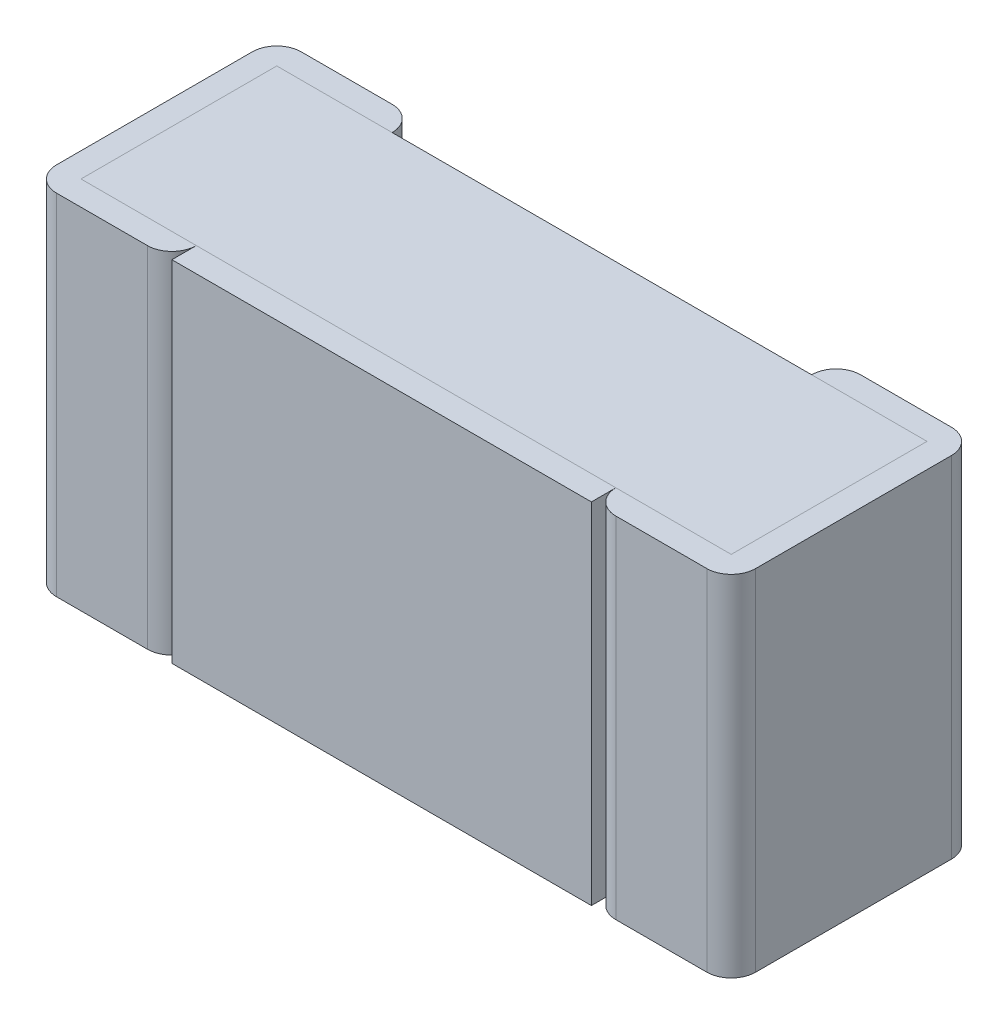
ISO-10303-21;
HEADER;
FILE_DESCRIPTION(('STEP AP214'),'2;1');
FILE_NAME('part.step','',(''),(''),'','','');
FILE_SCHEMA(('AUTOMOTIVE_DESIGN { 1 0 10303 214 1 1 1 1 }'));
ENDSEC;
DATA;
#1=APPLICATION_CONTEXT('core data for automotive mechanical design processes');
#2=APPLICATION_PROTOCOL_DEFINITION('international standard','automotive_design',2000,#1);
#3=PRODUCT_CONTEXT('',#1,'mechanical');
#4=PRODUCT('Part','Part','',(#3));
#5=PRODUCT_RELATED_PRODUCT_CATEGORY('part','',(#4));
#6=PRODUCT_DEFINITION_FORMATION('','',#4);
#7=PRODUCT_DEFINITION_CONTEXT('part definition',#1,'design');
#8=PRODUCT_DEFINITION('design','',#6,#7);
#9=PRODUCT_DEFINITION_SHAPE('','',#8);
#10=(LENGTH_UNIT() NAMED_UNIT(*) SI_UNIT(.MILLI.,.METRE.));
#11=(NAMED_UNIT(*) PLANE_ANGLE_UNIT() SI_UNIT($,.RADIAN.));
#12=(NAMED_UNIT(*) SI_UNIT($,.STERADIAN.) SOLID_ANGLE_UNIT());
#13=UNCERTAINTY_MEASURE_WITH_UNIT(LENGTH_MEASURE(1.E-05),#10,'distance_accuracy_value','');
#14=(GEOMETRIC_REPRESENTATION_CONTEXT(3) GLOBAL_UNCERTAINTY_ASSIGNED_CONTEXT((#13)) GLOBAL_UNIT_ASSIGNED_CONTEXT((#10,
#11,#12)) REPRESENTATION_CONTEXT('',''));
#15=CARTESIAN_POINT('',(0.,0.,0.));
#16=DIRECTION('',(0.,0.,1.));
#17=DIRECTION('',(1.,0.,0.));
#18=AXIS2_PLACEMENT_3D('',#15,#16,#17);
#19=CARTESIAN_POINT('',(-0.3,-0.25,0.35));
#20=DIRECTION('',(0.,0.,1.));
#21=DIRECTION('',(1.,0.,0.));
#22=AXIS2_PLACEMENT_3D('',#19,#20,#21);
#23=PLANE('',#22);
#24=DIRECTION('',(0.,1.,0.));
#25=VECTOR('',#24,1.);
#26=CARTESIAN_POINT('',(-0.3,-0.25,0.35));
#27=LINE('',#26,#25);
#28=CARTESIAN_POINT('',(-0.3,-0.25,0.35));
#29=VERTEX_POINT('',#28);
#30=CARTESIAN_POINT('',(-0.3,0.25,0.35));
#31=VERTEX_POINT('',#30);
#32=EDGE_CURVE('E232',#29,#31,#27,.T.);
#33=ORIENTED_EDGE('',*,*,#32,.F.);
#34=DIRECTION('',(1.,0.,0.));
#35=VECTOR('',#34,1.);
#36=CARTESIAN_POINT('',(-0.3,-0.25,0.35));
#37=LINE('',#36,#35);
#38=CARTESIAN_POINT('',(0.3,-0.25,0.35));
#39=VERTEX_POINT('',#38);
#40=EDGE_CURVE('E344',#29,#39,#37,.T.);
#41=ORIENTED_EDGE('',*,*,#40,.T.);
#42=DIRECTION('',(0.,1.,0.));
#43=VECTOR('',#42,1.);
#44=CARTESIAN_POINT('',(0.3,-0.25,0.35));
#45=LINE('',#44,#43);
#46=CARTESIAN_POINT('',(0.3,0.25,0.35));
#47=VERTEX_POINT('',#46);
#48=EDGE_CURVE('E11',#39,#47,#45,.T.);
#49=ORIENTED_EDGE('',*,*,#48,.T.);
#50=DIRECTION('',(1.,0.,0.));
#51=VECTOR('',#50,1.);
#52=CARTESIAN_POINT('',(-0.3,0.25,0.35));
#53=LINE('',#52,#51);
#54=EDGE_CURVE('E279',#31,#47,#53,.T.);
#55=ORIENTED_EDGE('',*,*,#54,.F.);
#56=EDGE_LOOP('',(#33,#41,#49,#55));
#57=FACE_BOUND('',#56,.T.);
#58=ADVANCED_FACE('F17',(#57),#23,.T.);
#59=CARTESIAN_POINT('',(0.3,-0.25,0.315));
#60=DIRECTION('',(1.,0.,0.));
#61=DIRECTION('',(0.,1.,0.));
#62=AXIS2_PLACEMENT_3D('',#59,#60,#61);
#63=PLANE('',#62);
#64=DIRECTION('',(0.,0.,1.));
#65=VECTOR('',#64,1.);
#66=CARTESIAN_POINT('',(0.3,-0.25,0.315));
#67=LINE('',#66,#65);
#68=CARTESIAN_POINT('',(0.3,-0.25,0.315));
#69=VERTEX_POINT('',#68);
#70=EDGE_CURVE('E340',#69,#39,#67,.T.);
#71=ORIENTED_EDGE('',*,*,#70,.F.);
#72=DIRECTION('',(0.,1.,0.));
#73=VECTOR('',#72,1.);
#74=CARTESIAN_POINT('',(0.3,-0.25,0.315));
#75=LINE('',#74,#73);
#76=CARTESIAN_POINT('',(0.3,0.25,0.315));
#77=VERTEX_POINT('',#76);
#78=EDGE_CURVE('E28',#69,#77,#75,.T.);
#79=ORIENTED_EDGE('',*,*,#78,.T.);
#80=DIRECTION('',(0.,0.,1.));
#81=VECTOR('',#80,1.);
#82=CARTESIAN_POINT('',(0.3,0.25,0.315));
#83=LINE('',#82,#81);
#84=EDGE_CURVE('E242',#77,#47,#83,.T.);
#85=ORIENTED_EDGE('',*,*,#84,.T.);
#86=ORIENTED_EDGE('',*,*,#48,.F.);
#87=EDGE_LOOP('',(#71,#79,#85,#86));
#88=FACE_BOUND('',#87,.T.);
#89=ADVANCED_FACE('F538',(#88),#63,.T.);
#90=CARTESIAN_POINT('',(0.335,-0.25,0.315));
#91=DIRECTION('',(0.,1.,0.));
#92=DIRECTION('',(-1.,0.,0.));
#93=AXIS2_PLACEMENT_3D('',#90,#91,#92);
#94=CYLINDRICAL_SURFACE('',#93,0.035);
#95=CARTESIAN_POINT('',(0.335,-0.25,0.315));
#96=DIRECTION('',(0.,1.,0.));
#97=DIRECTION('',(0.,0.,1.));
#98=AXIS2_PLACEMENT_3D('',#95,#96,#97);
#99=CIRCLE('',#98,0.035);
#100=CARTESIAN_POINT('',(0.335,-0.25,0.35));
#101=VERTEX_POINT('',#100);
#102=EDGE_CURVE('E375',#69,#101,#99,.T.);
#103=ORIENTED_EDGE('',*,*,#102,.T.);
#104=DIRECTION('',(0.,1.,0.));
#105=VECTOR('',#104,1.);
#106=CARTESIAN_POINT('',(0.335,-0.25,0.35));
#107=LINE('',#106,#105);
#108=CARTESIAN_POINT('',(0.335,0.25,0.35));
#109=VERTEX_POINT('',#108);
#110=EDGE_CURVE('E363',#101,#109,#107,.T.);
#111=ORIENTED_EDGE('',*,*,#110,.T.);
#112=CARTESIAN_POINT('',(0.335,0.25,0.315));
#113=DIRECTION('',(0.,1.,0.));
#114=DIRECTION('',(0.,0.,1.));
#115=AXIS2_PLACEMENT_3D('',#112,#113,#114);
#116=CIRCLE('',#115,0.035);
#117=EDGE_CURVE('E320',#77,#109,#116,.T.);
#118=ORIENTED_EDGE('',*,*,#117,.F.);
#119=ORIENTED_EDGE('',*,*,#78,.F.);
#120=EDGE_LOOP('',(#103,#111,#118,#119));
#121=FACE_BOUND('',#120,.T.);
#122=ADVANCED_FACE('F544',(#121),#94,.T.);
#123=CARTESIAN_POINT('',(0.3,-0.25,0.35));
#124=DIRECTION('',(0.,0.,1.));
#125=DIRECTION('',(1.,0.,0.));
#126=AXIS2_PLACEMENT_3D('',#123,#124,#125);
#127=PLANE('',#126);
#128=DIRECTION('',(1.,0.,0.));
#129=VECTOR('',#128,1.);
#130=CARTESIAN_POINT('',(0.3,0.25,0.35));
#131=LINE('',#130,#129);
#132=CARTESIAN_POINT('',(0.465,0.25,0.35));
#133=VERTEX_POINT('',#132);
#134=EDGE_CURVE('E315',#109,#133,#131,.T.);
#135=ORIENTED_EDGE('',*,*,#134,.F.);
#136=ORIENTED_EDGE('',*,*,#110,.F.);
#137=DIRECTION('',(1.,0.,0.));
#138=VECTOR('',#137,1.);
#139=CARTESIAN_POINT('',(0.3,-0.25,0.35));
#140=LINE('',#139,#138);
#141=CARTESIAN_POINT('',(0.465,-0.25,0.35));
#142=VERTEX_POINT('',#141);
#143=EDGE_CURVE('E308',#101,#142,#140,.T.);
#144=ORIENTED_EDGE('',*,*,#143,.T.);
#145=DIRECTION('',(0.,1.,0.));
#146=VECTOR('',#145,1.);
#147=CARTESIAN_POINT('',(0.465,-0.25,0.35));
#148=LINE('',#147,#146);
#149=EDGE_CURVE('E360',#142,#133,#148,.T.);
#150=ORIENTED_EDGE('',*,*,#149,.T.);
#151=EDGE_LOOP('',(#135,#136,#144,#150));
#152=FACE_BOUND('',#151,.T.);
#153=ADVANCED_FACE('F556',(#152),#127,.T.);
#154=CARTESIAN_POINT('',(0.465,-0.25,0.315));
#155=DIRECTION('',(0.,1.,0.));
#156=DIRECTION('',(1.,0.,0.));
#157=AXIS2_PLACEMENT_3D('',#154,#155,#156);
#158=CYLINDRICAL_SURFACE('',#157,0.035);
#159=DIRECTION('',(0.,1.,0.));
#160=VECTOR('',#159,1.);
#161=CARTESIAN_POINT('',(0.5,-0.25,0.315));
#162=LINE('',#161,#160);
#163=CARTESIAN_POINT('',(0.5,-0.25,0.315));
#164=VERTEX_POINT('',#163);
#165=CARTESIAN_POINT('',(0.5,0.25,0.315));
#166=VERTEX_POINT('',#165);
#167=EDGE_CURVE('E364',#164,#166,#162,.T.);
#168=ORIENTED_EDGE('',*,*,#167,.T.);
#169=CARTESIAN_POINT('',(0.465,0.25,0.315));
#170=DIRECTION('',(0.,-1.,0.));
#171=DIRECTION('',(0.,0.,1.));
#172=AXIS2_PLACEMENT_3D('',#169,#170,#171);
#173=CIRCLE('',#172,0.035);
#174=EDGE_CURVE('E319',#166,#133,#173,.T.);
#175=ORIENTED_EDGE('',*,*,#174,.T.);
#176=ORIENTED_EDGE('',*,*,#149,.F.);
#177=CARTESIAN_POINT('',(0.465,-0.25,0.315));
#178=DIRECTION('',(0.,-1.,0.));
#179=DIRECTION('',(0.,0.,1.));
#180=AXIS2_PLACEMENT_3D('',#177,#178,#179);
#181=CIRCLE('',#180,0.035);
#182=EDGE_CURVE('E305',#164,#142,#181,.T.);
#183=ORIENTED_EDGE('',*,*,#182,.F.);
#184=EDGE_LOOP('',(#168,#175,#176,#183));
#185=FACE_BOUND('',#184,.T.);
#186=ADVANCED_FACE('F502',(#185),#158,.T.);
#187=CARTESIAN_POINT('',(0.5,-0.25,0.));
#188=DIRECTION('',(1.,0.,0.));
#189=DIRECTION('',(0.,1.,0.));
#190=AXIS2_PLACEMENT_3D('',#187,#188,#189);
#191=PLANE('',#190);
#192=DIRECTION('',(0.,0.,1.));
#193=VECTOR('',#192,1.);
#194=CARTESIAN_POINT('',(0.5,-0.25,0.));
#195=LINE('',#194,#193);
#196=CARTESIAN_POINT('',(0.5,-0.25,0.035));
#197=VERTEX_POINT('',#196);
#198=EDGE_CURVE('E309',#197,#164,#195,.T.);
#199=ORIENTED_EDGE('',*,*,#198,.F.);
#200=DIRECTION('',(0.,1.,0.));
#201=VECTOR('',#200,1.);
#202=CARTESIAN_POINT('',(0.5,-0.25,0.035));
#203=LINE('',#202,#201);
#204=CARTESIAN_POINT('',(0.5,0.25,0.035));
#205=VERTEX_POINT('',#204);
#206=EDGE_CURVE('E403',#197,#205,#203,.T.);
#207=ORIENTED_EDGE('',*,*,#206,.T.);
#208=DIRECTION('',(0.,0.,1.));
#209=VECTOR('',#208,1.);
#210=CARTESIAN_POINT('',(0.5,0.25,0.));
#211=LINE('',#210,#209);
#212=EDGE_CURVE('E413',#205,#166,#211,.T.);
#213=ORIENTED_EDGE('',*,*,#212,.T.);
#214=ORIENTED_EDGE('',*,*,#167,.F.);
#215=EDGE_LOOP('',(#199,#207,#213,#214));
#216=FACE_BOUND('',#215,.T.);
#217=ADVANCED_FACE('F492',(#216),#191,.T.);
#218=CARTESIAN_POINT('',(0.465,-0.25,0.035));
#219=DIRECTION('',(0.,1.,0.));
#220=DIRECTION('',(1.,0.,0.));
#221=AXIS2_PLACEMENT_3D('',#218,#219,#220);
#222=CYLINDRICAL_SURFACE('',#221,0.035);
#223=CARTESIAN_POINT('',(0.465,-0.25,0.035));
#224=DIRECTION('',(0.,1.,0.));
#225=DIRECTION('',(0.,0.,1.));
#226=AXIS2_PLACEMENT_3D('',#223,#224,#225);
#227=CIRCLE('',#226,0.035);
#228=CARTESIAN_POINT('',(0.465,-0.25,0.));
#229=VERTEX_POINT('',#228);
#230=EDGE_CURVE('E370',#197,#229,#227,.T.);
#231=ORIENTED_EDGE('',*,*,#230,.T.);
#232=DIRECTION('',(0.,1.,0.));
#233=VECTOR('',#232,1.);
#234=CARTESIAN_POINT('',(0.465,-0.25,0.));
#235=LINE('',#234,#233);
#236=CARTESIAN_POINT('',(0.465,0.25,0.));
#237=VERTEX_POINT('',#236);
#238=EDGE_CURVE('E399',#229,#237,#235,.T.);
#239=ORIENTED_EDGE('',*,*,#238,.T.);
#240=CARTESIAN_POINT('',(0.465,0.25,0.035));
#241=DIRECTION('',(0.,1.,0.));
#242=DIRECTION('',(0.,0.,1.));
#243=AXIS2_PLACEMENT_3D('',#240,#241,#242);
#244=CIRCLE('',#243,0.035);
#245=EDGE_CURVE('E459',#205,#237,#244,.T.);
#246=ORIENTED_EDGE('',*,*,#245,.F.);
#247=ORIENTED_EDGE('',*,*,#206,.F.);
#248=EDGE_LOOP('',(#231,#239,#246,#247));
#249=FACE_BOUND('',#248,.T.);
#250=ADVANCED_FACE('F675',(#249),#222,.T.);
#251=CARTESIAN_POINT('',(0.3,-0.25,0.));
#252=DIRECTION('',(0.,0.,1.));
#253=DIRECTION('',(1.,0.,0.));
#254=AXIS2_PLACEMENT_3D('',#251,#252,#253);
#255=PLANE('',#254);
#256=ORIENTED_EDGE('',*,*,#238,.F.);
#257=DIRECTION('',(1.,0.,0.));
#258=VECTOR('',#257,1.);
#259=CARTESIAN_POINT('',(0.3,-0.25,0.));
#260=LINE('',#259,#258);
#261=CARTESIAN_POINT('',(0.335,-0.25,0.));
#262=VERTEX_POINT('',#261);
#263=EDGE_CURVE('E345',#262,#229,#260,.T.);
#264=ORIENTED_EDGE('',*,*,#263,.F.);
#265=DIRECTION('',(0.,1.,0.));
#266=VECTOR('',#265,1.);
#267=CARTESIAN_POINT('',(0.335,-0.25,0.));
#268=LINE('',#267,#266);
#269=CARTESIAN_POINT('',(0.335,0.25,0.));
#270=VERTEX_POINT('',#269);
#271=EDGE_CURVE('E404',#262,#270,#268,.T.);
#272=ORIENTED_EDGE('',*,*,#271,.T.);
#273=DIRECTION('',(1.,0.,0.));
#274=VECTOR('',#273,1.);
#275=CARTESIAN_POINT('',(0.3,0.25,0.));
#276=LINE('',#275,#274);
#277=EDGE_CURVE('E236',#270,#237,#276,.T.);
#278=ORIENTED_EDGE('',*,*,#277,.T.);
#279=EDGE_LOOP('',(#256,#264,#272,#278));
#280=FACE_BOUND('',#279,.T.);
#281=ADVANCED_FACE('F19',(#280),#255,.F.);
#282=CARTESIAN_POINT('',(0.335,-0.25,0.035));
#283=DIRECTION('',(0.,1.,0.));
#284=DIRECTION('',(-1.,0.,0.));
#285=AXIS2_PLACEMENT_3D('',#282,#283,#284);
#286=CYLINDRICAL_SURFACE('',#285,0.035);
#287=DIRECTION('',(0.,1.,0.));
#288=VECTOR('',#287,1.);
#289=CARTESIAN_POINT('',(0.3,-0.25,0.035));
#290=LINE('',#289,#288);
#291=CARTESIAN_POINT('',(0.3,-0.25,0.035));
#292=VERTEX_POINT('',#291);
#293=CARTESIAN_POINT('',(0.3,0.25,0.035));
#294=VERTEX_POINT('',#293);
#295=EDGE_CURVE('E371',#292,#294,#290,.T.);
#296=ORIENTED_EDGE('',*,*,#295,.T.);
#297=CARTESIAN_POINT('',(0.335,0.25,0.035));
#298=DIRECTION('',(0.,-1.,0.));
#299=DIRECTION('',(0.,0.,1.));
#300=AXIS2_PLACEMENT_3D('',#297,#298,#299);
#301=CIRCLE('',#300,0.035);
#302=EDGE_CURVE('E346',#294,#270,#301,.T.);
#303=ORIENTED_EDGE('',*,*,#302,.T.);
#304=ORIENTED_EDGE('',*,*,#271,.F.);
#305=CARTESIAN_POINT('',(0.335,-0.25,0.035));
#306=DIRECTION('',(0.,-1.,0.));
#307=DIRECTION('',(0.,0.,1.));
#308=AXIS2_PLACEMENT_3D('',#305,#306,#307);
#309=CIRCLE('',#308,0.035);
#310=EDGE_CURVE('E356',#292,#262,#309,.T.);
#311=ORIENTED_EDGE('',*,*,#310,.F.);
#312=EDGE_LOOP('',(#296,#303,#304,#311));
#313=FACE_BOUND('',#312,.T.);
#314=ADVANCED_FACE('F521',(#313),#286,.T.);
#315=CARTESIAN_POINT('',(-0.3,0.25,0.315));
#316=DIRECTION('',(0.,1.,0.));
#317=DIRECTION('',(1.,0.,0.));
#318=AXIS2_PLACEMENT_3D('',#315,#316,#317);
#319=PLANE('',#318);
#320=DIRECTION('',(1.,0.,0.));
#321=VECTOR('',#320,1.);
#322=CARTESIAN_POINT('',(-0.3,0.25,0.315));
#323=LINE('',#322,#321);
#324=CARTESIAN_POINT('',(-0.3,0.25,0.315));
#325=VERTEX_POINT('',#324);
#326=EDGE_CURVE('E240',#325,#77,#323,.T.);
#327=ORIENTED_EDGE('',*,*,#326,.F.);
#328=DIRECTION('',(0.,0.,1.));
#329=VECTOR('',#328,1.);
#330=CARTESIAN_POINT('',(-0.3,0.25,0.315));
#331=LINE('',#330,#329);
#332=EDGE_CURVE('E225',#325,#31,#331,.T.);
#333=ORIENTED_EDGE('',*,*,#332,.T.);
#334=ORIENTED_EDGE('',*,*,#54,.T.);
#335=ORIENTED_EDGE('',*,*,#84,.F.);
#336=EDGE_LOOP('',(#327,#333,#334,#335));
#337=FACE_BOUND('',#336,.T.);
#338=ADVANCED_FACE('F241',(#337),#319,.T.);
#339=CARTESIAN_POINT('',(0.3,0.25,0.));
#340=DIRECTION('',(0.,1.,0.));
#341=DIRECTION('',(1.,0.,0.));
#342=AXIS2_PLACEMENT_3D('',#339,#340,#341);
#343=PLANE('',#342);
#344=ORIENTED_EDGE('',*,*,#277,.F.);
#345=ORIENTED_EDGE('',*,*,#302,.F.);
#346=DIRECTION('',(1.,0.,0.));
#347=VECTOR('',#346,1.);
#348=CARTESIAN_POINT('',(-0.465,0.25,0.035));
#349=LINE('',#348,#347);
#350=CARTESIAN_POINT('',(0.465,0.25,0.035));
#351=VERTEX_POINT('',#350);
#352=EDGE_CURVE('E350',#294,#351,#349,.T.);
#353=ORIENTED_EDGE('',*,*,#352,.T.);
#354=DIRECTION('',(0.,0.,1.));
#355=VECTOR('',#354,1.);
#356=CARTESIAN_POINT('',(0.465,0.25,0.035));
#357=LINE('',#356,#355);
#358=CARTESIAN_POINT('',(0.465,0.25,0.315));
#359=VERTEX_POINT('',#358);
#360=EDGE_CURVE('E298',#351,#359,#357,.T.);
#361=ORIENTED_EDGE('',*,*,#360,.T.);
#362=DIRECTION('',(1.,0.,0.));
#363=VECTOR('',#362,1.);
#364=CARTESIAN_POINT('',(-0.465,0.25,0.315));
#365=LINE('',#364,#363);
#366=EDGE_CURVE('E248',#77,#359,#365,.T.);
#367=ORIENTED_EDGE('',*,*,#366,.F.);
#368=ORIENTED_EDGE('',*,*,#117,.T.);
#369=ORIENTED_EDGE('',*,*,#134,.T.);
#370=ORIENTED_EDGE('',*,*,#174,.F.);
#371=ORIENTED_EDGE('',*,*,#212,.F.);
#372=ORIENTED_EDGE('',*,*,#245,.T.);
#373=EDGE_LOOP('',(#344,#345,#353,#361,#367,#368,#369,#370,#371,#372));
#374=FACE_BOUND('',#373,.T.);
#375=ADVANCED_FACE('F498',(#374),#343,.T.);
#376=CARTESIAN_POINT('',(-0.3,-0.25,0.315));
#377=DIRECTION('',(1.,0.,0.));
#378=DIRECTION('',(0.,1.,0.));
#379=AXIS2_PLACEMENT_3D('',#376,#377,#378);
#380=PLANE('',#379);
#381=ORIENTED_EDGE('',*,*,#32,.T.);
#382=ORIENTED_EDGE('',*,*,#332,.F.);
#383=DIRECTION('',(0.,1.,0.));
#384=VECTOR('',#383,1.);
#385=CARTESIAN_POINT('',(-0.3,-0.25,0.315));
#386=LINE('',#385,#384);
#387=CARTESIAN_POINT('',(-0.3,-0.25,0.315));
#388=VERTEX_POINT('',#387);
#389=EDGE_CURVE('E230',#388,#325,#386,.T.);
#390=ORIENTED_EDGE('',*,*,#389,.F.);
#391=DIRECTION('',(0.,0.,1.));
#392=VECTOR('',#391,1.);
#393=CARTESIAN_POINT('',(-0.3,-0.25,0.315));
#394=LINE('',#393,#392);
#395=EDGE_CURVE('E381',#388,#29,#394,.T.);
#396=ORIENTED_EDGE('',*,*,#395,.T.);
#397=EDGE_LOOP('',(#381,#382,#390,#396));
#398=FACE_BOUND('',#397,.T.);
#399=ADVANCED_FACE('F227',(#398),#380,.F.);
#400=CARTESIAN_POINT('',(-0.3,-0.25,0.315));
#401=DIRECTION('',(0.,1.,0.));
#402=DIRECTION('',(1.,0.,0.));
#403=AXIS2_PLACEMENT_3D('',#400,#401,#402);
#404=PLANE('',#403);
#405=ORIENTED_EDGE('',*,*,#70,.T.);
#406=ORIENTED_EDGE('',*,*,#40,.F.);
#407=ORIENTED_EDGE('',*,*,#395,.F.);
#408=DIRECTION('',(1.,0.,0.));
#409=VECTOR('',#408,1.);
#410=CARTESIAN_POINT('',(-0.3,-0.25,0.315));
#411=LINE('',#410,#409);
#412=EDGE_CURVE('E335',#388,#69,#411,.T.);
#413=ORIENTED_EDGE('',*,*,#412,.T.);
#414=EDGE_LOOP('',(#405,#406,#407,#413));
#415=FACE_BOUND('',#414,.T.);
#416=ADVANCED_FACE('F475',(#415),#404,.F.);
#417=CARTESIAN_POINT('',(0.3,-0.25,0.));
#418=DIRECTION('',(0.,1.,0.));
#419=DIRECTION('',(1.,0.,0.));
#420=AXIS2_PLACEMENT_3D('',#417,#418,#419);
#421=PLANE('',#420);
#422=ORIENTED_EDGE('',*,*,#230,.F.);
#423=ORIENTED_EDGE('',*,*,#198,.T.);
#424=ORIENTED_EDGE('',*,*,#182,.T.);
#425=ORIENTED_EDGE('',*,*,#143,.F.);
#426=ORIENTED_EDGE('',*,*,#102,.F.);
#427=DIRECTION('',(1.,0.,0.));
#428=VECTOR('',#427,1.);
#429=CARTESIAN_POINT('',(-0.465,-0.25,0.315));
#430=LINE('',#429,#428);
#431=CARTESIAN_POINT('',(0.465,-0.25,0.315));
#432=VERTEX_POINT('',#431);
#433=EDGE_CURVE('E339',#69,#432,#430,.T.);
#434=ORIENTED_EDGE('',*,*,#433,.T.);
#435=DIRECTION('',(0.,0.,1.));
#436=VECTOR('',#435,1.);
#437=CARTESIAN_POINT('',(0.465,-0.25,0.035));
#438=LINE('',#437,#436);
#439=CARTESIAN_POINT('',(0.465,-0.25,0.035));
#440=VERTEX_POINT('',#439);
#441=EDGE_CURVE('E428',#440,#432,#438,.T.);
#442=ORIENTED_EDGE('',*,*,#441,.F.);
#443=DIRECTION('',(1.,0.,0.));
#444=VECTOR('',#443,1.);
#445=CARTESIAN_POINT('',(-0.465,-0.25,0.035));
#446=LINE('',#445,#444);
#447=EDGE_CURVE('E294',#292,#440,#446,.T.);
#448=ORIENTED_EDGE('',*,*,#447,.F.);
#449=ORIENTED_EDGE('',*,*,#310,.T.);
#450=ORIENTED_EDGE('',*,*,#263,.T.);
#451=EDGE_LOOP('',(#422,#423,#424,#425,#426,#434,#442,#448,#449,#450));
#452=FACE_BOUND('',#451,.T.);
#453=ADVANCED_FACE('F506',(#452),#421,.F.);
#454=CARTESIAN_POINT('',(-0.465,-0.25,0.035));
#455=DIRECTION('',(0.,0.,1.));
#456=DIRECTION('',(1.,0.,0.));
#457=AXIS2_PLACEMENT_3D('',#454,#455,#456);
#458=PLANE('',#457);
#459=DIRECTION('',(1.,0.,0.));
#460=VECTOR('',#459,1.);
#461=CARTESIAN_POINT('',(-0.465,0.25,0.035));
#462=LINE('',#461,#460);
#463=CARTESIAN_POINT('',(-0.3,0.25,0.035));
#464=VERTEX_POINT('',#463);
#465=EDGE_CURVE('E21',#464,#294,#462,.T.);
#466=ORIENTED_EDGE('',*,*,#465,.T.);
#467=ORIENTED_EDGE('',*,*,#295,.F.);
#468=DIRECTION('',(1.,0.,0.));
#469=VECTOR('',#468,1.);
#470=CARTESIAN_POINT('',(-0.465,-0.25,0.035));
#471=LINE('',#470,#469);
#472=CARTESIAN_POINT('',(-0.3,-0.25,0.035));
#473=VERTEX_POINT('',#472);
#474=EDGE_CURVE('E290',#473,#292,#471,.T.);
#475=ORIENTED_EDGE('',*,*,#474,.F.);
#476=DIRECTION('',(0.,1.,0.));
#477=VECTOR('',#476,1.);
#478=CARTESIAN_POINT('',(-0.3,-0.25,0.035));
#479=LINE('',#478,#477);
#480=EDGE_CURVE('E295',#473,#464,#479,.T.);
#481=ORIENTED_EDGE('',*,*,#480,.T.);
#482=EDGE_LOOP('',(#466,#467,#475,#481));
#483=FACE_BOUND('',#482,.T.);
#484=ADVANCED_FACE('F528',(#483),#458,.F.);
#485=CARTESIAN_POINT('',(-0.465,0.25,0.035));
#486=DIRECTION('',(0.,1.,0.));
#487=DIRECTION('',(1.,0.,0.));
#488=AXIS2_PLACEMENT_3D('',#485,#486,#487);
#489=PLANE('',#488);
#490=DIRECTION('',(1.,0.,0.));
#491=VECTOR('',#490,1.);
#492=CARTESIAN_POINT('',(-0.465,0.25,0.035));
#493=LINE('',#492,#491);
#494=CARTESIAN_POINT('',(-0.465,0.25,0.035));
#495=VERTEX_POINT('',#494);
#496=EDGE_CURVE('E284',#495,#464,#493,.T.);
#497=ORIENTED_EDGE('',*,*,#496,.F.);
#498=DIRECTION('',(0.,0.,1.));
#499=VECTOR('',#498,1.);
#500=CARTESIAN_POINT('',(-0.465,0.25,0.035));
#501=LINE('',#500,#499);
#502=CARTESIAN_POINT('',(-0.465,0.25,0.315));
#503=VERTEX_POINT('',#502);
#504=EDGE_CURVE('E266',#495,#503,#501,.T.);
#505=ORIENTED_EDGE('',*,*,#504,.T.);
#506=DIRECTION('',(1.,0.,0.));
#507=VECTOR('',#506,1.);
#508=CARTESIAN_POINT('',(-0.465,0.25,0.315));
#509=LINE('',#508,#507);
#510=EDGE_CURVE('E263',#503,#325,#509,.T.);
#511=ORIENTED_EDGE('',*,*,#510,.T.);
#512=ORIENTED_EDGE('',*,*,#326,.T.);
#513=ORIENTED_EDGE('',*,*,#366,.T.);
#514=ORIENTED_EDGE('',*,*,#360,.F.);
#515=ORIENTED_EDGE('',*,*,#352,.F.);
#516=ORIENTED_EDGE('',*,*,#465,.F.);
#517=EDGE_LOOP('',(#497,#505,#511,#512,#513,#514,#515,#516));
#518=FACE_BOUND('',#517,.T.);
#519=ADVANCED_FACE('F264',(#518),#489,.T.);
#520=CARTESIAN_POINT('',(-0.335,-0.25,0.315));
#521=DIRECTION('',(0.,1.,0.));
#522=DIRECTION('',(1.,0.,0.));
#523=AXIS2_PLACEMENT_3D('',#520,#521,#522);
#524=CYLINDRICAL_SURFACE('',#523,0.035);
#525=ORIENTED_EDGE('',*,*,#389,.T.);
#526=CARTESIAN_POINT('',(-0.335,0.25,0.315));
#527=DIRECTION('',(0.,-1.,0.));
#528=DIRECTION('',(0.,0.,1.));
#529=AXIS2_PLACEMENT_3D('',#526,#527,#528);
#530=CIRCLE('',#529,0.035);
#531=CARTESIAN_POINT('',(-0.335,0.25,0.35));
#532=VERTEX_POINT('',#531);
#533=EDGE_CURVE('E255',#325,#532,#530,.T.);
#534=ORIENTED_EDGE('',*,*,#533,.T.);
#535=DIRECTION('',(0.,1.,0.));
#536=VECTOR('',#535,1.);
#537=CARTESIAN_POINT('',(-0.335,-0.25,0.35));
#538=LINE('',#537,#536);
#539=CARTESIAN_POINT('',(-0.335,-0.25,0.35));
#540=VERTEX_POINT('',#539);
#541=EDGE_CURVE('E260',#540,#532,#538,.T.);
#542=ORIENTED_EDGE('',*,*,#541,.F.);
#543=CARTESIAN_POINT('',(-0.335,-0.25,0.315));
#544=DIRECTION('',(0.,-1.,0.));
#545=DIRECTION('',(0.,0.,1.));
#546=AXIS2_PLACEMENT_3D('',#543,#544,#545);
#547=CIRCLE('',#546,0.035);
#548=EDGE_CURVE('E257',#388,#540,#547,.T.);
#549=ORIENTED_EDGE('',*,*,#548,.F.);
#550=EDGE_LOOP('',(#525,#534,#542,#549));
#551=FACE_BOUND('',#550,.T.);
#552=ADVANCED_FACE('F253',(#551),#524,.T.);
#553=CARTESIAN_POINT('',(-0.5,-0.25,0.35));
#554=DIRECTION('',(0.,0.,1.));
#555=DIRECTION('',(1.,0.,0.));
#556=AXIS2_PLACEMENT_3D('',#553,#554,#555);
#557=PLANE('',#556);
#558=DIRECTION('',(1.,0.,0.));
#559=VECTOR('',#558,1.);
#560=CARTESIAN_POINT('',(-0.5,0.25,0.35));
#561=LINE('',#560,#559);
#562=CARTESIAN_POINT('',(-0.465,0.25,0.35));
#563=VERTEX_POINT('',#562);
#564=EDGE_CURVE('E160',#563,#532,#561,.T.);
#565=ORIENTED_EDGE('',*,*,#564,.F.);
#566=DIRECTION('',(0.,1.,0.));
#567=VECTOR('',#566,1.);
#568=CARTESIAN_POINT('',(-0.465,-0.25,0.35));
#569=LINE('',#568,#567);
#570=CARTESIAN_POINT('',(-0.465,-0.25,0.35));
#571=VERTEX_POINT('',#570);
#572=EDGE_CURVE('E389',#571,#563,#569,.T.);
#573=ORIENTED_EDGE('',*,*,#572,.F.);
#574=DIRECTION('',(1.,0.,0.));
#575=VECTOR('',#574,1.);
#576=CARTESIAN_POINT('',(-0.5,-0.25,0.35));
#577=LINE('',#576,#575);
#578=EDGE_CURVE('E409',#571,#540,#577,.T.);
#579=ORIENTED_EDGE('',*,*,#578,.T.);
#580=ORIENTED_EDGE('',*,*,#541,.T.);
#581=EDGE_LOOP('',(#565,#573,#579,#580));
#582=FACE_BOUND('',#581,.T.);
#583=ADVANCED_FACE('F572',(#582),#557,.T.);
#584=CARTESIAN_POINT('',(-0.465,-0.25,0.035));
#585=DIRECTION('',(0.,1.,0.));
#586=DIRECTION('',(1.,0.,0.));
#587=AXIS2_PLACEMENT_3D('',#584,#585,#586);
#588=PLANE('',#587);
#589=ORIENTED_EDGE('',*,*,#474,.T.);
#590=ORIENTED_EDGE('',*,*,#447,.T.);
#591=ORIENTED_EDGE('',*,*,#441,.T.);
#592=ORIENTED_EDGE('',*,*,#433,.F.);
#593=ORIENTED_EDGE('',*,*,#412,.F.);
#594=DIRECTION('',(1.,0.,0.));
#595=VECTOR('',#594,1.);
#596=CARTESIAN_POINT('',(-0.465,-0.25,0.315));
#597=LINE('',#596,#595);
#598=CARTESIAN_POINT('',(-0.465,-0.25,0.315));
#599=VERTEX_POINT('',#598);
#600=EDGE_CURVE('E311',#599,#388,#597,.T.);
#601=ORIENTED_EDGE('',*,*,#600,.F.);
#602=DIRECTION('',(0.,0.,1.));
#603=VECTOR('',#602,1.);
#604=CARTESIAN_POINT('',(-0.465,-0.25,0.035));
#605=LINE('',#604,#603);
#606=CARTESIAN_POINT('',(-0.465,-0.25,0.035));
#607=VERTEX_POINT('',#606);
#608=EDGE_CURVE('E314',#607,#599,#605,.T.);
#609=ORIENTED_EDGE('',*,*,#608,.F.);
#610=DIRECTION('',(1.,0.,0.));
#611=VECTOR('',#610,1.);
#612=CARTESIAN_POINT('',(-0.465,-0.25,0.035));
#613=LINE('',#612,#611);
#614=EDGE_CURVE('E325',#607,#473,#613,.T.);
#615=ORIENTED_EDGE('',*,*,#614,.T.);
#616=EDGE_LOOP('',(#589,#590,#591,#592,#593,#601,#609,#615));
#617=FACE_BOUND('',#616,.T.);
#618=ADVANCED_FACE('F472',(#617),#588,.F.);
#619=CARTESIAN_POINT('',(-0.335,-0.25,0.035));
#620=DIRECTION('',(0.,1.,0.));
#621=DIRECTION('',(1.,0.,0.));
#622=AXIS2_PLACEMENT_3D('',#619,#620,#621);
#623=CYLINDRICAL_SURFACE('',#622,0.035);
#624=CARTESIAN_POINT('',(-0.335,-0.25,0.035));
#625=DIRECTION('',(0.,1.,0.));
#626=DIRECTION('',(0.,0.,1.));
#627=AXIS2_PLACEMENT_3D('',#624,#625,#626);
#628=CIRCLE('',#627,0.035);
#629=CARTESIAN_POINT('',(-0.335,-0.25,0.));
#630=VERTEX_POINT('',#629);
#631=EDGE_CURVE('E321',#473,#630,#628,.T.);
#632=ORIENTED_EDGE('',*,*,#631,.T.);
#633=DIRECTION('',(0.,1.,0.));
#634=VECTOR('',#633,1.);
#635=CARTESIAN_POINT('',(-0.335,-0.25,0.));
#636=LINE('',#635,#634);
#637=CARTESIAN_POINT('',(-0.335,0.25,0.));
#638=VERTEX_POINT('',#637);
#639=EDGE_CURVE('E283',#630,#638,#636,.T.);
#640=ORIENTED_EDGE('',*,*,#639,.T.);
#641=CARTESIAN_POINT('',(-0.335,0.25,0.035));
#642=DIRECTION('',(0.,1.,0.));
#643=DIRECTION('',(0.,0.,1.));
#644=AXIS2_PLACEMENT_3D('',#641,#642,#643);
#645=CIRCLE('',#644,0.035);
#646=EDGE_CURVE('E281',#464,#638,#645,.T.);
#647=ORIENTED_EDGE('',*,*,#646,.F.);
#648=ORIENTED_EDGE('',*,*,#480,.F.);
#649=EDGE_LOOP('',(#632,#640,#647,#648));
#650=FACE_BOUND('',#649,.T.);
#651=ADVANCED_FACE('F531',(#650),#623,.T.);
#652=CARTESIAN_POINT('',(-0.5,-0.25,0.));
#653=DIRECTION('',(0.,0.,1.));
#654=DIRECTION('',(1.,0.,0.));
#655=AXIS2_PLACEMENT_3D('',#652,#653,#654);
#656=PLANE('',#655);
#657=ORIENTED_EDGE('',*,*,#639,.F.);
#658=DIRECTION('',(1.,0.,0.));
#659=VECTOR('',#658,1.);
#660=CARTESIAN_POINT('',(-0.5,-0.25,0.));
#661=LINE('',#660,#659);
#662=CARTESIAN_POINT('',(-0.465,-0.25,0.));
#663=VERTEX_POINT('',#662);
#664=EDGE_CURVE('E299',#663,#630,#661,.T.);
#665=ORIENTED_EDGE('',*,*,#664,.F.);
#666=DIRECTION('',(0.,1.,0.));
#667=VECTOR('',#666,1.);
#668=CARTESIAN_POINT('',(-0.465,-0.25,0.));
#669=LINE('',#668,#667);
#670=CARTESIAN_POINT('',(-0.465,0.25,0.));
#671=VERTEX_POINT('',#670);
#672=EDGE_CURVE('E139',#663,#671,#669,.T.);
#673=ORIENTED_EDGE('',*,*,#672,.T.);
#674=DIRECTION('',(1.,0.,0.));
#675=VECTOR('',#674,1.);
#676=CARTESIAN_POINT('',(-0.5,0.25,0.));
#677=LINE('',#676,#675);
#678=EDGE_CURVE('E149',#671,#638,#677,.T.);
#679=ORIENTED_EDGE('',*,*,#678,.T.);
#680=EDGE_LOOP('',(#657,#665,#673,#679));
#681=FACE_BOUND('',#680,.T.);
#682=ADVANCED_FACE('F603',(#681),#656,.F.);
#683=CARTESIAN_POINT('',(-0.5,0.25,0.));
#684=DIRECTION('',(0.,1.,0.));
#685=DIRECTION('',(1.,0.,0.));
#686=AXIS2_PLACEMENT_3D('',#683,#684,#685);
#687=PLANE('',#686);
#688=ORIENTED_EDGE('',*,*,#678,.F.);
#689=CARTESIAN_POINT('',(-0.465,0.25,0.035));
#690=DIRECTION('',(0.,-1.,0.));
#691=DIRECTION('',(0.,0.,1.));
#692=AXIS2_PLACEMENT_3D('',#689,#690,#691);
#693=CIRCLE('',#692,0.035);
#694=CARTESIAN_POINT('',(-0.5,0.25,0.035));
#695=VERTEX_POINT('',#694);
#696=EDGE_CURVE('E303',#695,#671,#693,.T.);
#697=ORIENTED_EDGE('',*,*,#696,.F.);
#698=DIRECTION('',(0.,0.,1.));
#699=VECTOR('',#698,1.);
#700=CARTESIAN_POINT('',(-0.5,0.25,0.));
#701=LINE('',#700,#699);
#702=CARTESIAN_POINT('',(-0.5,0.25,0.315));
#703=VERTEX_POINT('',#702);
#704=EDGE_CURVE('E285',#695,#703,#701,.T.);
#705=ORIENTED_EDGE('',*,*,#704,.T.);
#706=CARTESIAN_POINT('',(-0.465,0.25,0.315));
#707=DIRECTION('',(0.,1.,0.));
#708=DIRECTION('',(0.,0.,1.));
#709=AXIS2_PLACEMENT_3D('',#706,#707,#708);
#710=CIRCLE('',#709,0.035);
#711=EDGE_CURVE('E191',#703,#563,#710,.T.);
#712=ORIENTED_EDGE('',*,*,#711,.T.);
#713=ORIENTED_EDGE('',*,*,#564,.T.);
#714=ORIENTED_EDGE('',*,*,#533,.F.);
#715=ORIENTED_EDGE('',*,*,#510,.F.);
#716=ORIENTED_EDGE('',*,*,#504,.F.);
#717=ORIENTED_EDGE('',*,*,#496,.T.);
#718=ORIENTED_EDGE('',*,*,#646,.T.);
#719=EDGE_LOOP('',(#688,#697,#705,#712,#713,#714,#715,#716,#717,#718));
#720=FACE_BOUND('',#719,.T.);
#721=ADVANCED_FACE('F269',(#720),#687,.T.);
#722=CARTESIAN_POINT('',(-0.465,-0.25,0.315));
#723=DIRECTION('',(0.,1.,0.));
#724=DIRECTION('',(-1.,0.,0.));
#725=AXIS2_PLACEMENT_3D('',#722,#723,#724);
#726=CYLINDRICAL_SURFACE('',#725,0.035);
#727=CARTESIAN_POINT('',(-0.465,-0.25,0.315));
#728=DIRECTION('',(0.,1.,0.));
#729=DIRECTION('',(0.,0.,1.));
#730=AXIS2_PLACEMENT_3D('',#727,#728,#729);
#731=CIRCLE('',#730,0.035);
#732=CARTESIAN_POINT('',(-0.5,-0.25,0.315));
#733=VERTEX_POINT('',#732);
#734=EDGE_CURVE('E180',#733,#571,#731,.T.);
#735=ORIENTED_EDGE('',*,*,#734,.T.);
#736=ORIENTED_EDGE('',*,*,#572,.T.);
#737=ORIENTED_EDGE('',*,*,#711,.F.);
#738=DIRECTION('',(0.,1.,0.));
#739=VECTOR('',#738,1.);
#740=CARTESIAN_POINT('',(-0.5,-0.25,0.315));
#741=LINE('',#740,#739);
#742=EDGE_CURVE('E289',#733,#703,#741,.T.);
#743=ORIENTED_EDGE('',*,*,#742,.F.);
#744=EDGE_LOOP('',(#735,#736,#737,#743));
#745=FACE_BOUND('',#744,.T.);
#746=ADVANCED_FACE('F695',(#745),#726,.T.);
#747=CARTESIAN_POINT('',(-0.465,-0.25,0.035));
#748=DIRECTION('',(0.,1.,0.));
#749=DIRECTION('',(-1.,0.,0.));
#750=AXIS2_PLACEMENT_3D('',#747,#748,#749);
#751=CYLINDRICAL_SURFACE('',#750,0.035);
#752=DIRECTION('',(0.,1.,0.));
#753=VECTOR('',#752,1.);
#754=CARTESIAN_POINT('',(-0.5,-0.25,0.035));
#755=LINE('',#754,#753);
#756=CARTESIAN_POINT('',(-0.5,-0.25,0.035));
#757=VERTEX_POINT('',#756);
#758=EDGE_CURVE('E288',#757,#695,#755,.T.);
#759=ORIENTED_EDGE('',*,*,#758,.T.);
#760=ORIENTED_EDGE('',*,*,#696,.T.);
#761=ORIENTED_EDGE('',*,*,#672,.F.);
#762=CARTESIAN_POINT('',(-0.465,-0.25,0.035));
#763=DIRECTION('',(0.,-1.,0.));
#764=DIRECTION('',(0.,0.,1.));
#765=AXIS2_PLACEMENT_3D('',#762,#763,#764);
#766=CIRCLE('',#765,0.035);
#767=EDGE_CURVE('E304',#757,#663,#766,.T.);
#768=ORIENTED_EDGE('',*,*,#767,.F.);
#769=EDGE_LOOP('',(#759,#760,#761,#768));
#770=FACE_BOUND('',#769,.T.);
#771=ADVANCED_FACE('F722',(#770),#751,.T.);
#772=CARTESIAN_POINT('',(-0.5,-0.25,0.));
#773=DIRECTION('',(0.,1.,0.));
#774=DIRECTION('',(1.,0.,0.));
#775=AXIS2_PLACEMENT_3D('',#772,#773,#774);
#776=PLANE('',#775);
#777=ORIENTED_EDGE('',*,*,#631,.F.);
#778=ORIENTED_EDGE('',*,*,#614,.F.);
#779=ORIENTED_EDGE('',*,*,#608,.T.);
#780=ORIENTED_EDGE('',*,*,#600,.T.);
#781=ORIENTED_EDGE('',*,*,#548,.T.);
#782=ORIENTED_EDGE('',*,*,#578,.F.);
#783=ORIENTED_EDGE('',*,*,#734,.F.);
#784=DIRECTION('',(0.,0.,1.));
#785=VECTOR('',#784,1.);
#786=CARTESIAN_POINT('',(-0.5,-0.25,0.));
#787=LINE('',#786,#785);
#788=EDGE_CURVE('E326',#757,#733,#787,.T.);
#789=ORIENTED_EDGE('',*,*,#788,.F.);
#790=ORIENTED_EDGE('',*,*,#767,.T.);
#791=ORIENTED_EDGE('',*,*,#664,.T.);
#792=EDGE_LOOP('',(#777,#778,#779,#780,#781,#782,#783,#789,#790,#791));
#793=FACE_BOUND('',#792,.T.);
#794=ADVANCED_FACE('F466',(#793),#776,.F.);
#795=CARTESIAN_POINT('',(-0.5,-0.25,0.));
#796=DIRECTION('',(1.,0.,0.));
#797=DIRECTION('',(0.,1.,0.));
#798=AXIS2_PLACEMENT_3D('',#795,#796,#797);
#799=PLANE('',#798);
#800=ORIENTED_EDGE('',*,*,#742,.T.);
#801=ORIENTED_EDGE('',*,*,#704,.F.);
#802=ORIENTED_EDGE('',*,*,#758,.F.);
#803=ORIENTED_EDGE('',*,*,#788,.T.);
#804=EDGE_LOOP('',(#800,#801,#802,#803));
#805=FACE_BOUND('',#804,.T.);
#806=ADVANCED_FACE('F642',(#805),#799,.F.);
#807=CLOSED_SHELL('',(#58,#89,#122,#153,#186,#217,#250,#281,#314,#338,#375,#399,#416,#453,#484,
#519,#552,#583,#618,#651,#682,#721,#746,#771,#794,#806));
#808=MANIFOLD_SOLID_BREP('B1',#807);
#809=ADVANCED_BREP_SHAPE_REPRESENTATION('',(#18,#808),#14);
#810=SHAPE_DEFINITION_REPRESENTATION(#9,#809);
ENDSEC;
END-ISO-10303-21;
